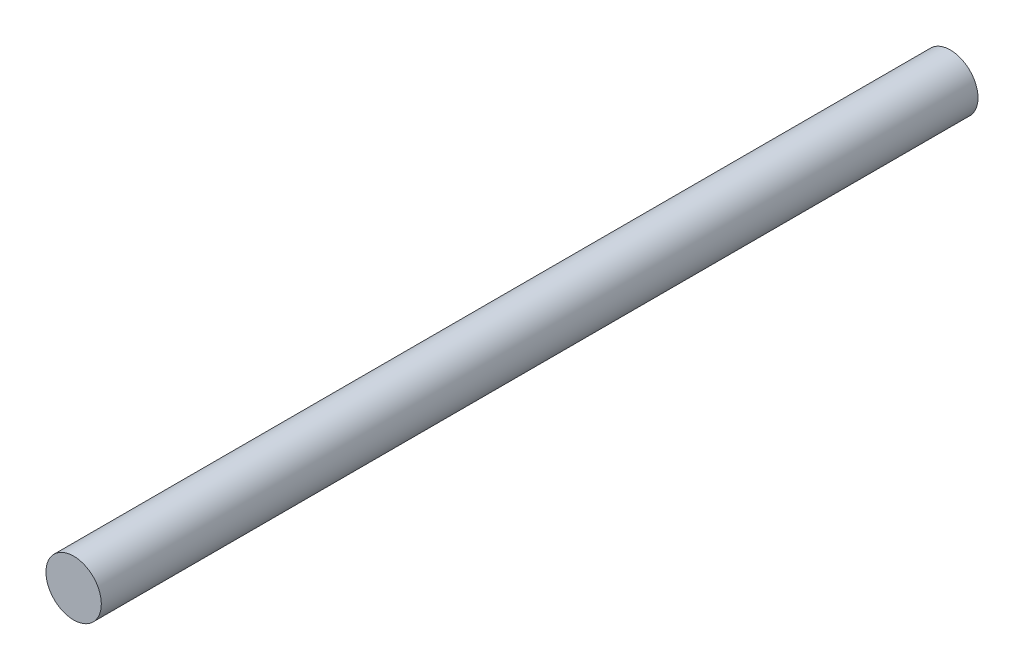
ISO-10303-21;
HEADER;
FILE_DESCRIPTION(('STEP AP214'),'2;1');
FILE_NAME('part.step','',(''),(''),'','','');
FILE_SCHEMA(('AUTOMOTIVE_DESIGN { 1 0 10303 214 1 1 1 1 }'));
ENDSEC;
DATA;
#1=APPLICATION_CONTEXT('core data for automotive mechanical design processes');
#2=APPLICATION_PROTOCOL_DEFINITION('international standard','automotive_design',2000,#1);
#3=PRODUCT_CONTEXT('',#1,'mechanical');
#4=PRODUCT('Part','Part','',(#3));
#5=PRODUCT_RELATED_PRODUCT_CATEGORY('part','',(#4));
#6=PRODUCT_DEFINITION_FORMATION('','',#4);
#7=PRODUCT_DEFINITION_CONTEXT('part definition',#1,'design');
#8=PRODUCT_DEFINITION('design','',#6,#7);
#9=PRODUCT_DEFINITION_SHAPE('','',#8);
#10=(LENGTH_UNIT() NAMED_UNIT(*) SI_UNIT(.MILLI.,.METRE.));
#11=(NAMED_UNIT(*) PLANE_ANGLE_UNIT() SI_UNIT($,.RADIAN.));
#12=(NAMED_UNIT(*) SI_UNIT($,.STERADIAN.) SOLID_ANGLE_UNIT());
#13=UNCERTAINTY_MEASURE_WITH_UNIT(LENGTH_MEASURE(1.E-05),#10,'distance_accuracy_value','');
#14=(GEOMETRIC_REPRESENTATION_CONTEXT(3) GLOBAL_UNCERTAINTY_ASSIGNED_CONTEXT((#13)) GLOBAL_UNIT_ASSIGNED_CONTEXT((#10,
#11,#12)) REPRESENTATION_CONTEXT('',''));
#15=CARTESIAN_POINT('',(0.,0.,0.));
#16=DIRECTION('',(0.,0.,1.));
#17=DIRECTION('',(1.,0.,0.));
#18=AXIS2_PLACEMENT_3D('',#15,#16,#17);
#19=CARTESIAN_POINT('',(0.,0.,190.));
#20=DIRECTION('',(0.,0.,-1.));
#21=DIRECTION('',(-1.,0.,0.));
#22=AXIS2_PLACEMENT_3D('',#19,#20,#21);
#23=CYLINDRICAL_SURFACE('',#22,6.);
#24=CARTESIAN_POINT('',(0.,0.,190.));
#25=DIRECTION('',(0.,0.,1.));
#26=DIRECTION('',(1.,0.,0.));
#27=AXIS2_PLACEMENT_3D('',#24,#25,#26);
#28=CIRCLE('',#27,6.);
#29=CARTESIAN_POINT('',(6.,0.,190.));
#30=VERTEX_POINT('',#29);
#31=EDGE_CURVE('E10',#30,#30,#28,.T.);
#32=ORIENTED_EDGE('',*,*,#31,.F.);
#33=EDGE_LOOP('',(#32));
#34=FACE_BOUND('',#33,.T.);
#35=CARTESIAN_POINT('',(0.,0.,0.));
#36=DIRECTION('',(0.,0.,1.));
#37=DIRECTION('',(1.,0.,0.));
#38=AXIS2_PLACEMENT_3D('',#35,#36,#37);
#39=CIRCLE('',#38,6.);
#40=CARTESIAN_POINT('',(6.,0.,0.));
#41=VERTEX_POINT('',#40);
#42=EDGE_CURVE('E40',#41,#41,#39,.T.);
#43=ORIENTED_EDGE('',*,*,#42,.T.);
#44=EDGE_LOOP('',(#43));
#45=FACE_BOUND('',#44,.T.);
#46=ADVANCED_FACE('F37',(#34,#45),#23,.T.);
#47=CARTESIAN_POINT('',(0.,0.,190.));
#48=DIRECTION('',(0.,0.,1.));
#49=DIRECTION('',(1.,0.,0.));
#50=AXIS2_PLACEMENT_3D('',#47,#48,#49);
#51=PLANE('',#50);
#52=ORIENTED_EDGE('',*,*,#31,.T.);
#53=EDGE_LOOP('',(#52));
#54=FACE_BOUND('',#53,.T.);
#55=ADVANCED_FACE('F54',(#54),#51,.T.);
#56=CARTESIAN_POINT('',(0.,0.,0.));
#57=DIRECTION('',(0.,0.,1.));
#58=DIRECTION('',(1.,0.,0.));
#59=AXIS2_PLACEMENT_3D('',#56,#57,#58);
#60=PLANE('',#59);
#61=ORIENTED_EDGE('',*,*,#42,.F.);
#62=EDGE_LOOP('',(#61));
#63=FACE_BOUND('',#62,.T.);
#64=ADVANCED_FACE('F52',(#63),#60,.F.);
#65=CLOSED_SHELL('',(#46,#55,#64));
#66=MANIFOLD_SOLID_BREP('B2',#65);
#67=ADVANCED_BREP_SHAPE_REPRESENTATION('',(#18,#66),#14);
#68=SHAPE_DEFINITION_REPRESENTATION(#9,#67);
ENDSEC;
END-ISO-10303-21;
